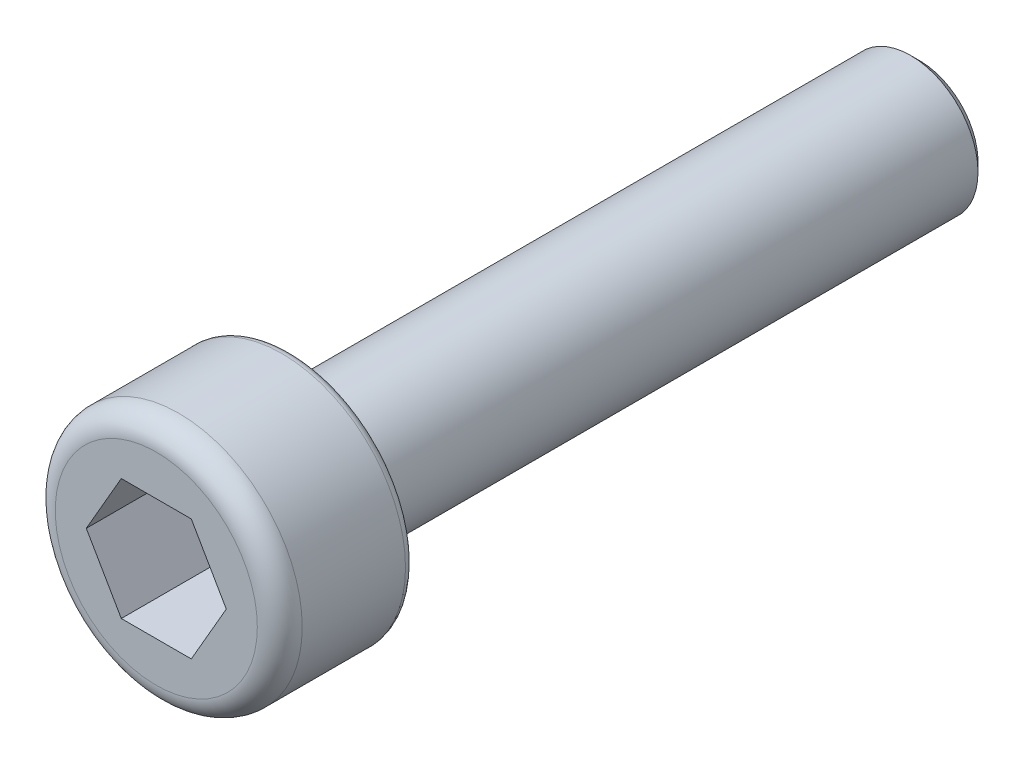
ISO-10303-21;
HEADER;
FILE_DESCRIPTION(('STEP AP214'),'2;1');
FILE_NAME('part.step','',(''),(''),'','','');
FILE_SCHEMA(('AUTOMOTIVE_DESIGN { 1 0 10303 214 1 1 1 1 }'));
ENDSEC;
DATA;
#1=APPLICATION_CONTEXT('core data for automotive mechanical design processes');
#2=APPLICATION_PROTOCOL_DEFINITION('international standard','automotive_design',2000,#1);
#3=PRODUCT_CONTEXT('',#1,'mechanical');
#4=PRODUCT('Part','Part','',(#3));
#5=PRODUCT_RELATED_PRODUCT_CATEGORY('part','',(#4));
#6=PRODUCT_DEFINITION_FORMATION('','',#4);
#7=PRODUCT_DEFINITION_CONTEXT('part definition',#1,'design');
#8=PRODUCT_DEFINITION('design','',#6,#7);
#9=PRODUCT_DEFINITION_SHAPE('','',#8);
#10=(LENGTH_UNIT() NAMED_UNIT(*) SI_UNIT(.MILLI.,.METRE.));
#11=(NAMED_UNIT(*) PLANE_ANGLE_UNIT() SI_UNIT($,.RADIAN.));
#12=(NAMED_UNIT(*) SI_UNIT($,.STERADIAN.) SOLID_ANGLE_UNIT());
#13=UNCERTAINTY_MEASURE_WITH_UNIT(LENGTH_MEASURE(1.E-05),#10,'distance_accuracy_value','');
#14=(GEOMETRIC_REPRESENTATION_CONTEXT(3) GLOBAL_UNCERTAINTY_ASSIGNED_CONTEXT((#13)) GLOBAL_UNIT_ASSIGNED_CONTEXT((#10,
#11,#12)) REPRESENTATION_CONTEXT('',''));
#15=CARTESIAN_POINT('',(0.,0.,0.));
#16=DIRECTION('',(0.,0.,1.));
#17=DIRECTION('',(1.,0.,0.));
#18=AXIS2_PLACEMENT_3D('',#15,#16,#17);
#19=CARTESIAN_POINT('',(0.,0.,0.));
#20=DIRECTION('',(0.,0.,1.));
#21=DIRECTION('',(1.,0.,0.));
#22=AXIS2_PLACEMENT_3D('',#19,#20,#21);
#23=PLANE('',#22);
#24=CARTESIAN_POINT('',(0.,0.,0.));
#25=DIRECTION('',(0.,0.,1.));
#26=DIRECTION('',(1.,0.,0.));
#27=AXIS2_PLACEMENT_3D('',#24,#25,#26);
#28=CIRCLE('',#27,2.55);
#29=CARTESIAN_POINT('',(2.55,0.,0.));
#30=VERTEX_POINT('',#29);
#31=EDGE_CURVE('E11',#30,#30,#28,.F.);
#32=ORIENTED_EDGE('',*,*,#31,.T.);
#33=EDGE_LOOP('',(#32));
#34=FACE_BOUND('',#33,.T.);
#35=CARTESIAN_POINT('',(0.,0.,0.));
#36=DIRECTION('',(0.,0.,1.));
#37=DIRECTION('',(1.,0.,0.));
#38=AXIS2_PLACEMENT_3D('',#35,#36,#37);
#39=CIRCLE('',#38,1.5);
#40=CARTESIAN_POINT('',(1.5,0.,0.));
#41=VERTEX_POINT('',#40);
#42=EDGE_CURVE('E149',#41,#41,#39,.F.);
#43=ORIENTED_EDGE('',*,*,#42,.F.);
#44=EDGE_LOOP('',(#43));
#45=FACE_BOUND('',#44,.T.);
#46=ADVANCED_FACE('F36',(#34,#45),#23,.F.);
#47=CARTESIAN_POINT('',(0.,0.,3.));
#48=DIRECTION('',(0.,0.,-1.));
#49=DIRECTION('',(-1.,0.,0.));
#50=AXIS2_PLACEMENT_3D('',#47,#48,#49);
#51=CYLINDRICAL_SURFACE('',#50,2.75);
#52=CARTESIAN_POINT('',(0.,0.,0.2));
#53=DIRECTION('',(0.,0.,1.));
#54=DIRECTION('',(1.,0.,0.));
#55=AXIS2_PLACEMENT_3D('',#52,#53,#54);
#56=CIRCLE('',#55,2.75);
#57=CARTESIAN_POINT('',(2.75,0.,0.2));
#58=VERTEX_POINT('',#57);
#59=EDGE_CURVE('E44',#58,#58,#56,.T.);
#60=ORIENTED_EDGE('',*,*,#59,.T.);
#61=EDGE_LOOP('',(#60));
#62=FACE_BOUND('',#61,.T.);
#63=CARTESIAN_POINT('',(0.,0.,2.5));
#64=DIRECTION('',(0.,0.,1.));
#65=DIRECTION('',(1.,0.,0.));
#66=AXIS2_PLACEMENT_3D('',#63,#64,#65);
#67=CIRCLE('',#66,2.75);
#68=CARTESIAN_POINT('',(2.75,0.,2.5));
#69=VERTEX_POINT('',#68);
#70=EDGE_CURVE('E146',#69,#69,#67,.F.);
#71=ORIENTED_EDGE('',*,*,#70,.T.);
#72=EDGE_LOOP('',(#71));
#73=FACE_BOUND('',#72,.T.);
#74=ADVANCED_FACE('F160',(#62,#73),#51,.T.);
#75=CARTESIAN_POINT('',(0.,0.,3.));
#76=DIRECTION('',(0.,0.,1.));
#77=DIRECTION('',(1.,0.,0.));
#78=AXIS2_PLACEMENT_3D('',#75,#76,#77);
#79=PLANE('',#78);
#80=DIRECTION('',(0.5,0.866025403784439,0.));
#81=VECTOR('',#80,1.);
#82=CARTESIAN_POINT('',(0.779422863405995,-1.35,3.));
#83=LINE('',#82,#81);
#84=CARTESIAN_POINT('',(0.779422863405995,-1.35,3.));
#85=VERTEX_POINT('',#84);
#86=CARTESIAN_POINT('',(1.55884572681199,0.,3.));
#87=VERTEX_POINT('',#86);
#88=EDGE_CURVE('E51',#85,#87,#83,.T.);
#89=ORIENTED_EDGE('',*,*,#88,.F.);
#90=DIRECTION('',(1.,0.,0.));
#91=VECTOR('',#90,1.);
#92=CARTESIAN_POINT('',(-0.779422863405994,-1.35,3.));
#93=LINE('',#92,#91);
#94=CARTESIAN_POINT('',(-0.779422863405994,-1.35,3.));
#95=VERTEX_POINT('',#94);
#96=EDGE_CURVE('E134',#95,#85,#93,.T.);
#97=ORIENTED_EDGE('',*,*,#96,.F.);
#98=DIRECTION('',(0.5,-0.866025403784438,0.));
#99=VECTOR('',#98,1.);
#100=CARTESIAN_POINT('',(-1.55884572681199,0.,3.));
#101=LINE('',#100,#99);
#102=CARTESIAN_POINT('',(-1.55884572681199,0.,3.));
#103=VERTEX_POINT('',#102);
#104=EDGE_CURVE('E132',#103,#95,#101,.T.);
#105=ORIENTED_EDGE('',*,*,#104,.F.);
#106=DIRECTION('',(-0.5,-0.866025403784438,0.));
#107=VECTOR('',#106,1.);
#108=CARTESIAN_POINT('',(-0.779422863405995,1.35,3.));
#109=LINE('',#108,#107);
#110=CARTESIAN_POINT('',(-0.779422863405995,1.35,3.));
#111=VERTEX_POINT('',#110);
#112=EDGE_CURVE('E99',#111,#103,#109,.T.);
#113=ORIENTED_EDGE('',*,*,#112,.F.);
#114=DIRECTION('',(-1.,0.,0.));
#115=VECTOR('',#114,1.);
#116=CARTESIAN_POINT('',(0.779422863405994,1.35,3.));
#117=LINE('',#116,#115);
#118=CARTESIAN_POINT('',(0.779422863405994,1.35,3.));
#119=VERTEX_POINT('',#118);
#120=EDGE_CURVE('E128',#119,#111,#117,.T.);
#121=ORIENTED_EDGE('',*,*,#120,.F.);
#122=DIRECTION('',(-0.5,0.866025403784438,0.));
#123=VECTOR('',#122,1.);
#124=CARTESIAN_POINT('',(1.55884572681199,0.,3.));
#125=LINE('',#124,#123);
#126=EDGE_CURVE('E125',#87,#119,#125,.T.);
#127=ORIENTED_EDGE('',*,*,#126,.F.);
#128=EDGE_LOOP('',(#89,#97,#105,#113,#121,#127));
#129=FACE_BOUND('',#128,.T.);
#130=CARTESIAN_POINT('',(0.,0.,3.));
#131=DIRECTION('',(0.,0.,1.));
#132=DIRECTION('',(1.,0.,0.));
#133=AXIS2_PLACEMENT_3D('',#130,#131,#132);
#134=CIRCLE('',#133,2.25);
#135=CARTESIAN_POINT('',(2.25,0.,3.));
#136=VERTEX_POINT('',#135);
#137=EDGE_CURVE('E138',#136,#136,#134,.T.);
#138=ORIENTED_EDGE('',*,*,#137,.T.);
#139=EDGE_LOOP('',(#138));
#140=FACE_BOUND('',#139,.T.);
#141=ADVANCED_FACE('F178',(#129,#140),#79,.T.);
#142=CARTESIAN_POINT('',(0.,0.,2.5));
#143=DIRECTION('',(0.,0.,1.));
#144=DIRECTION('',(1.,0.,0.));
#145=AXIS2_PLACEMENT_3D('',#142,#143,#144);
#146=TOROIDAL_SURFACE('',#145,2.25,0.5);
#147=ORIENTED_EDGE('',*,*,#70,.F.);
#148=EDGE_LOOP('',(#147));
#149=FACE_BOUND('',#148,.T.);
#150=ORIENTED_EDGE('',*,*,#137,.F.);
#151=EDGE_LOOP('',(#150));
#152=FACE_BOUND('',#151,.T.);
#153=ADVANCED_FACE('F184',(#149,#152),#146,.T.);
#154=CARTESIAN_POINT('',(0.779422863405995,-1.35,1.));
#155=DIRECTION('',(0.866025403784439,-0.5,0.));
#156=DIRECTION('',(0.5,0.866025403784439,0.));
#157=AXIS2_PLACEMENT_3D('',#154,#155,#156);
#158=PLANE('',#157);
#159=ORIENTED_EDGE('',*,*,#88,.T.);
#160=DIRECTION('',(0.,0.,1.));
#161=VECTOR('',#160,1.);
#162=CARTESIAN_POINT('',(1.55884572681199,0.,1.));
#163=LINE('',#162,#161);
#164=CARTESIAN_POINT('',(1.55884572681199,0.,1.));
#165=VERTEX_POINT('',#164);
#166=EDGE_CURVE('E81',#165,#87,#163,.T.);
#167=ORIENTED_EDGE('',*,*,#166,.F.);
#168=DIRECTION('',(0.5,0.866025403784439,0.));
#169=VECTOR('',#168,1.);
#170=CARTESIAN_POINT('',(0.779422863405995,-1.35,1.));
#171=LINE('',#170,#169);
#172=CARTESIAN_POINT('',(0.779422863405995,-1.35,1.));
#173=VERTEX_POINT('',#172);
#174=EDGE_CURVE('E136',#173,#165,#171,.T.);
#175=ORIENTED_EDGE('',*,*,#174,.F.);
#176=DIRECTION('',(0.,0.,1.));
#177=VECTOR('',#176,1.);
#178=CARTESIAN_POINT('',(0.779422863405995,-1.35,1.));
#179=LINE('',#178,#177);
#180=EDGE_CURVE('E59',#173,#85,#179,.T.);
#181=ORIENTED_EDGE('',*,*,#180,.T.);
#182=EDGE_LOOP('',(#159,#167,#175,#181));
#183=FACE_BOUND('',#182,.T.);
#184=ADVANCED_FACE('F186',(#183),#158,.F.);
#185=CARTESIAN_POINT('',(-0.779422863405994,-1.35,1.));
#186=DIRECTION('',(0.,-1.,0.));
#187=DIRECTION('',(0.,0.,-1.));
#188=AXIS2_PLACEMENT_3D('',#185,#186,#187);
#189=PLANE('',#188);
#190=ORIENTED_EDGE('',*,*,#96,.T.);
#191=ORIENTED_EDGE('',*,*,#180,.F.);
#192=DIRECTION('',(1.,0.,0.));
#193=VECTOR('',#192,1.);
#194=CARTESIAN_POINT('',(-0.779422863405994,-1.35,1.));
#195=LINE('',#194,#193);
#196=CARTESIAN_POINT('',(-0.779422863405994,-1.35,1.));
#197=VERTEX_POINT('',#196);
#198=EDGE_CURVE('E111',#197,#173,#195,.T.);
#199=ORIENTED_EDGE('',*,*,#198,.F.);
#200=DIRECTION('',(0.,0.,1.));
#201=VECTOR('',#200,1.);
#202=CARTESIAN_POINT('',(-0.779422863405994,-1.35,1.));
#203=LINE('',#202,#201);
#204=EDGE_CURVE('E103',#197,#95,#203,.T.);
#205=ORIENTED_EDGE('',*,*,#204,.T.);
#206=EDGE_LOOP('',(#190,#191,#199,#205));
#207=FACE_BOUND('',#206,.T.);
#208=ADVANCED_FACE('F192',(#207),#189,.F.);
#209=CARTESIAN_POINT('',(-1.55884572681199,0.,1.));
#210=DIRECTION('',(-0.866025403784438,-0.5,0.));
#211=DIRECTION('',(0.5,-0.866025403784438,0.));
#212=AXIS2_PLACEMENT_3D('',#209,#210,#211);
#213=PLANE('',#212);
#214=ORIENTED_EDGE('',*,*,#104,.T.);
#215=ORIENTED_EDGE('',*,*,#204,.F.);
#216=DIRECTION('',(0.5,-0.866025403784438,0.));
#217=VECTOR('',#216,1.);
#218=CARTESIAN_POINT('',(-1.55884572681199,0.,1.));
#219=LINE('',#218,#217);
#220=CARTESIAN_POINT('',(-1.55884572681199,0.,1.));
#221=VERTEX_POINT('',#220);
#222=EDGE_CURVE('E107',#221,#197,#219,.T.);
#223=ORIENTED_EDGE('',*,*,#222,.F.);
#224=DIRECTION('',(0.,0.,1.));
#225=VECTOR('',#224,1.);
#226=CARTESIAN_POINT('',(-1.55884572681199,0.,1.));
#227=LINE('',#226,#225);
#228=EDGE_CURVE('E92',#221,#103,#227,.T.);
#229=ORIENTED_EDGE('',*,*,#228,.T.);
#230=EDGE_LOOP('',(#214,#215,#223,#229));
#231=FACE_BOUND('',#230,.T.);
#232=ADVANCED_FACE('F108',(#231),#213,.F.);
#233=CARTESIAN_POINT('',(-0.779422863405995,1.35,1.));
#234=DIRECTION('',(-0.866025403784439,0.5,0.));
#235=DIRECTION('',(-0.5,-0.866025403784439,0.));
#236=AXIS2_PLACEMENT_3D('',#233,#234,#235);
#237=PLANE('',#236);
#238=ORIENTED_EDGE('',*,*,#112,.T.);
#239=ORIENTED_EDGE('',*,*,#228,.F.);
#240=DIRECTION('',(-0.5,-0.866025403784438,0.));
#241=VECTOR('',#240,1.);
#242=CARTESIAN_POINT('',(-0.779422863405995,1.35,1.));
#243=LINE('',#242,#241);
#244=CARTESIAN_POINT('',(-0.779422863405995,1.35,1.));
#245=VERTEX_POINT('',#244);
#246=EDGE_CURVE('E96',#245,#221,#243,.T.);
#247=ORIENTED_EDGE('',*,*,#246,.F.);
#248=DIRECTION('',(0.,0.,1.));
#249=VECTOR('',#248,1.);
#250=CARTESIAN_POINT('',(-0.779422863405995,1.35,1.));
#251=LINE('',#250,#249);
#252=EDGE_CURVE('E104',#245,#111,#251,.T.);
#253=ORIENTED_EDGE('',*,*,#252,.T.);
#254=EDGE_LOOP('',(#238,#239,#247,#253));
#255=FACE_BOUND('',#254,.T.);
#256=ADVANCED_FACE('F94',(#255),#237,.F.);
#257=CARTESIAN_POINT('',(0.779422863405994,1.35,1.));
#258=DIRECTION('',(0.,1.,0.));
#259=DIRECTION('',(0.,0.,1.));
#260=AXIS2_PLACEMENT_3D('',#257,#258,#259);
#261=PLANE('',#260);
#262=ORIENTED_EDGE('',*,*,#120,.T.);
#263=ORIENTED_EDGE('',*,*,#252,.F.);
#264=DIRECTION('',(-1.,0.,0.));
#265=VECTOR('',#264,1.);
#266=CARTESIAN_POINT('',(0.779422863405994,1.35,1.));
#267=LINE('',#266,#265);
#268=CARTESIAN_POINT('',(0.779422863405994,1.35,1.));
#269=VERTEX_POINT('',#268);
#270=EDGE_CURVE('E117',#269,#245,#267,.T.);
#271=ORIENTED_EDGE('',*,*,#270,.F.);
#272=DIRECTION('',(0.,0.,1.));
#273=VECTOR('',#272,1.);
#274=CARTESIAN_POINT('',(0.779422863405994,1.35,1.));
#275=LINE('',#274,#273);
#276=EDGE_CURVE('E141',#269,#119,#275,.T.);
#277=ORIENTED_EDGE('',*,*,#276,.T.);
#278=EDGE_LOOP('',(#262,#263,#271,#277));
#279=FACE_BOUND('',#278,.T.);
#280=ADVANCED_FACE('F217',(#279),#261,.F.);
#281=CARTESIAN_POINT('',(1.55884572681199,0.,1.));
#282=DIRECTION('',(0.866025403784438,0.5,0.));
#283=DIRECTION('',(-0.5,0.866025403784438,0.));
#284=AXIS2_PLACEMENT_3D('',#281,#282,#283);
#285=PLANE('',#284);
#286=ORIENTED_EDGE('',*,*,#126,.T.);
#287=ORIENTED_EDGE('',*,*,#276,.F.);
#288=DIRECTION('',(-0.5,0.866025403784438,0.));
#289=VECTOR('',#288,1.);
#290=CARTESIAN_POINT('',(1.55884572681199,0.,1.));
#291=LINE('',#290,#289);
#292=EDGE_CURVE('E119',#165,#269,#291,.T.);
#293=ORIENTED_EDGE('',*,*,#292,.F.);
#294=ORIENTED_EDGE('',*,*,#166,.T.);
#295=EDGE_LOOP('',(#286,#287,#293,#294));
#296=FACE_BOUND('',#295,.T.);
#297=ADVANCED_FACE('F204',(#296),#285,.F.);
#298=CARTESIAN_POINT('',(0.,0.,1.));
#299=DIRECTION('',(0.,0.,1.));
#300=DIRECTION('',(1.,0.,0.));
#301=AXIS2_PLACEMENT_3D('',#298,#299,#300);
#302=PLANE('',#301);
#303=ORIENTED_EDGE('',*,*,#174,.T.);
#304=ORIENTED_EDGE('',*,*,#292,.T.);
#305=ORIENTED_EDGE('',*,*,#270,.T.);
#306=ORIENTED_EDGE('',*,*,#246,.T.);
#307=ORIENTED_EDGE('',*,*,#222,.T.);
#308=ORIENTED_EDGE('',*,*,#198,.T.);
#309=EDGE_LOOP('',(#303,#304,#305,#306,#307,#308));
#310=FACE_BOUND('',#309,.T.);
#311=ADVANCED_FACE('F114',(#310),#302,.T.);
#312=CARTESIAN_POINT('',(0.,0.,-14.));
#313=DIRECTION('',(0.,0.,1.));
#314=DIRECTION('',(1.,0.,0.));
#315=AXIS2_PLACEMENT_3D('',#312,#313,#314);
#316=CYLINDRICAL_SURFACE('',#315,1.5);
#317=CARTESIAN_POINT('',(0.,0.,-13.8));
#318=DIRECTION('',(0.,0.,-1.));
#319=DIRECTION('',(-1.,0.,0.));
#320=AXIS2_PLACEMENT_3D('',#317,#318,#319);
#321=CIRCLE('',#320,1.5);
#322=CARTESIAN_POINT('',(-1.5,0.,-13.8));
#323=VERTEX_POINT('',#322);
#324=EDGE_CURVE('E155',#323,#323,#321,.F.);
#325=ORIENTED_EDGE('',*,*,#324,.T.);
#326=EDGE_LOOP('',(#325));
#327=FACE_BOUND('',#326,.T.);
#328=ORIENTED_EDGE('',*,*,#42,.T.);
#329=EDGE_LOOP('',(#328));
#330=FACE_BOUND('',#329,.T.);
#331=ADVANCED_FACE('F225',(#327,#330),#316,.T.);
#332=CARTESIAN_POINT('',(0.,0.,-14.));
#333=DIRECTION('',(0.,0.,-1.));
#334=DIRECTION('',(-1.,0.,0.));
#335=AXIS2_PLACEMENT_3D('',#332,#333,#334);
#336=PLANE('',#335);
#337=CARTESIAN_POINT('',(0.,0.,-14.));
#338=DIRECTION('',(0.,0.,-1.));
#339=DIRECTION('',(-1.,0.,0.));
#340=AXIS2_PLACEMENT_3D('',#337,#338,#339);
#341=CIRCLE('',#340,1.3);
#342=CARTESIAN_POINT('',(-1.3,0.,-14.));
#343=VERTEX_POINT('',#342);
#344=EDGE_CURVE('E152',#343,#343,#341,.T.);
#345=ORIENTED_EDGE('',*,*,#344,.T.);
#346=EDGE_LOOP('',(#345));
#347=FACE_BOUND('',#346,.T.);
#348=ADVANCED_FACE('F169',(#347),#336,.T.);
#349=CARTESIAN_POINT('',(0.,0.,-14.));
#350=DIRECTION('',(0.,0.,1.));
#351=DIRECTION('',(1.,0.,0.));
#352=AXIS2_PLACEMENT_3D('',#349,#350,#351);
#353=CONICAL_SURFACE('',#352,1.3,0.78539816339745);
#354=ORIENTED_EDGE('',*,*,#324,.F.);
#355=EDGE_LOOP('',(#354));
#356=FACE_BOUND('',#355,.T.);
#357=ORIENTED_EDGE('',*,*,#344,.F.);
#358=EDGE_LOOP('',(#357));
#359=FACE_BOUND('',#358,.T.);
#360=ADVANCED_FACE('F164',(#356,#359),#353,.T.);
#361=CARTESIAN_POINT('',(0.,0.,0.2));
#362=DIRECTION('',(0.,0.,1.));
#363=DIRECTION('',(1.,0.,0.));
#364=AXIS2_PLACEMENT_3D('',#361,#362,#363);
#365=TOROIDAL_SURFACE('',#364,2.55,0.2);
#366=ORIENTED_EDGE('',*,*,#31,.F.);
#367=EDGE_LOOP('',(#366));
#368=FACE_BOUND('',#367,.T.);
#369=ORIENTED_EDGE('',*,*,#59,.F.);
#370=EDGE_LOOP('',(#369));
#371=FACE_BOUND('',#370,.T.);
#372=ADVANCED_FACE('F38',(#368,#371),#365,.T.);
#373=CLOSED_SHELL('',(#46,#74,#141,#153,#184,#208,#232,#256,#280,#297,#311,#331,#348,#360,#372));
#374=MANIFOLD_SOLID_BREP('B2',#373);
#375=ADVANCED_BREP_SHAPE_REPRESENTATION('',(#18,#374),#14);
#376=SHAPE_DEFINITION_REPRESENTATION(#9,#375);
ENDSEC;
END-ISO-10303-21;
